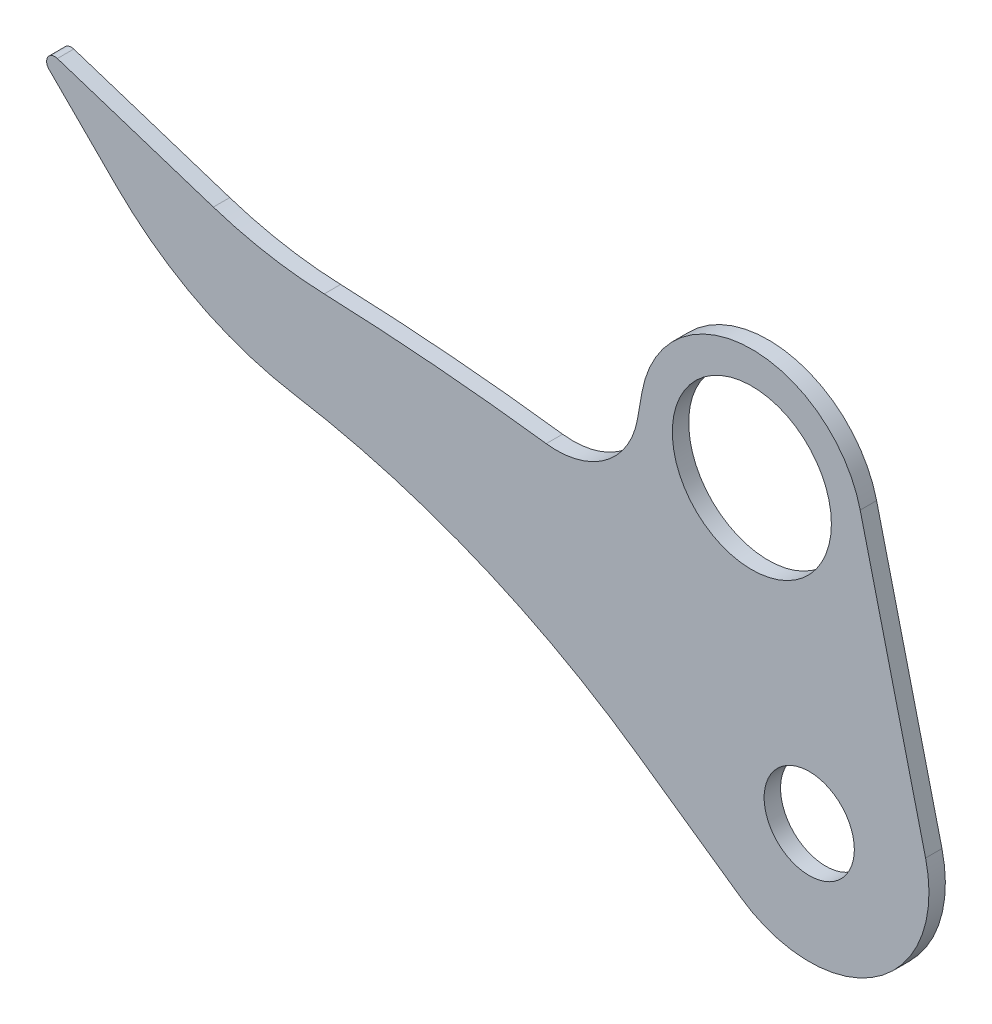
ISO-10303-21;
HEADER;
FILE_DESCRIPTION(('STEP AP214'),'2;1');
FILE_NAME('part.step','',(''),(''),'','','');
FILE_SCHEMA(('AUTOMOTIVE_DESIGN { 1 0 10303 214 1 1 1 1 }'));
ENDSEC;
DATA;
#1=APPLICATION_CONTEXT('core data for automotive mechanical design processes');
#2=APPLICATION_PROTOCOL_DEFINITION('international standard','automotive_design',2000,#1);
#3=PRODUCT_CONTEXT('',#1,'mechanical');
#4=PRODUCT('Part','Part','',(#3));
#5=PRODUCT_RELATED_PRODUCT_CATEGORY('part','',(#4));
#6=PRODUCT_DEFINITION_FORMATION('','',#4);
#7=PRODUCT_DEFINITION_CONTEXT('part definition',#1,'design');
#8=PRODUCT_DEFINITION('design','',#6,#7);
#9=PRODUCT_DEFINITION_SHAPE('','',#8);
#10=(LENGTH_UNIT() NAMED_UNIT(*) SI_UNIT(.MILLI.,.METRE.));
#11=(NAMED_UNIT(*) PLANE_ANGLE_UNIT() SI_UNIT($,.RADIAN.));
#12=(NAMED_UNIT(*) SI_UNIT($,.STERADIAN.) SOLID_ANGLE_UNIT());
#13=UNCERTAINTY_MEASURE_WITH_UNIT(LENGTH_MEASURE(1.E-05),#10,'distance_accuracy_value','');
#14=(GEOMETRIC_REPRESENTATION_CONTEXT(3) GLOBAL_UNCERTAINTY_ASSIGNED_CONTEXT((#13)) GLOBAL_UNIT_ASSIGNED_CONTEXT((#10,
#11,#12)) REPRESENTATION_CONTEXT('',''));
#15=CARTESIAN_POINT('',(0.,0.,0.));
#16=DIRECTION('',(0.,0.,1.));
#17=DIRECTION('',(1.,0.,0.));
#18=AXIS2_PLACEMENT_3D('',#15,#16,#17);
#19=CARTESIAN_POINT('',(0.,0.,10.));
#20=DIRECTION('',(0.,0.,1.));
#21=DIRECTION('',(1.,0.,0.));
#22=AXIS2_PLACEMENT_3D('',#19,#20,#21);
#23=PLANE('',#22);
#24=CARTESIAN_POINT('',(0.,0.,10.));
#25=DIRECTION('',(0.,0.,1.));
#26=DIRECTION('',(1.,0.,0.));
#27=AXIS2_PLACEMENT_3D('',#24,#25,#26);
#28=CIRCLE('',#27,27.5);
#29=CARTESIAN_POINT('',(27.5,0.,10.));
#30=VERTEX_POINT('',#29);
#31=EDGE_CURVE('E170',#30,#30,#28,.T.);
#32=ORIENTED_EDGE('',*,*,#31,.F.);
#33=EDGE_LOOP('',(#32));
#34=FACE_BOUND('',#33,.T.);
#35=CARTESIAN_POINT('',(0.,0.,10.));
#36=DIRECTION('',(0.,0.,1.));
#37=DIRECTION('',(1.,0.,0.));
#38=AXIS2_PLACEMENT_3D('',#35,#36,#37);
#39=CIRCLE('',#38,73.);
#40=CARTESIAN_POINT('',(-41.8710798536264,-59.7980992330963,10.));
#41=VERTEX_POINT('',#40);
#42=CARTESIAN_POINT('',(70.9306751457126,17.2580220006057,10.));
#43=VERTEX_POINT('',#42);
#44=EDGE_CURVE('E200',#41,#43,#39,.T.);
#45=ORIENTED_EDGE('',*,*,#44,.T.);
#46=DIRECTION('',(-0.23641126028227,0.971653084187844,0.));
#47=VECTOR('',#46,1.);
#48=CARTESIAN_POINT('',(70.9306751457126,17.2580220006057,10.));
#49=LINE('',#48,#47);
#50=CARTESIAN_POINT('',(31.0724097247734,181.075965699194,10.));
#51=VERTEX_POINT('',#50);
#52=EDGE_CURVE('E109',#43,#51,#49,.T.);
#53=ORIENTED_EDGE('',*,*,#52,.T.);
#54=CARTESIAN_POINT('',(-35.,165.,10.));
#55=DIRECTION('',(0.,0.,1.));
#56=DIRECTION('',(1.,0.,0.));
#57=AXIS2_PLACEMENT_3D('',#54,#55,#56);
#58=CIRCLE('',#57,68.);
#59=CARTESIAN_POINT('',(-101.96692720483,176.808076081351,10.));
#60=VERTEX_POINT('',#59);
#61=EDGE_CURVE('E225',#51,#60,#58,.T.);
#62=ORIENTED_EDGE('',*,*,#61,.T.);
#63=DIRECTION('',(-0.173648177666925,-0.984807753012209,0.));
#64=VECTOR('',#63,1.);
#65=CARTESIAN_POINT('',(-101.96692720483,176.808076081351,10.));
#66=LINE('',#65,#64);
#67=CARTESIAN_POINT('',(-104.698317648365,161.317591116654,10.));
#68=VERTEX_POINT('',#67);
#69=EDGE_CURVE('E237',#60,#68,#66,.T.);
#70=ORIENTED_EDGE('',*,*,#69,.T.);
#71=CARTESIAN_POINT('',(-153.938705298976,170.,10.));
#72=DIRECTION('',(0.,0.,1.));
#73=DIRECTION('',(1.,0.,0.));
#74=AXIS2_PLACEMENT_3D('',#71,#72,#73);
#75=CIRCLE('',#74,49.9999999999997);
#76=CARTESIAN_POINT('',(-160.381803444753,120.416872967875,10.));
#77=VERTEX_POINT('',#76);
#78=EDGE_CURVE('E239',#77,#68,#75,.T.);
#79=ORIENTED_EDGE('',*,*,#78,.F.);
#80=CARTESIAN_POINT('',(-353.674747818068,-1367.07693799589,10.));
#81=DIRECTION('',(0.,0.,1.));
#82=DIRECTION('',(1.,0.,0.));
#83=AXIS2_PLACEMENT_3D('',#80,#81,#82);
#84=CIRCLE('',#83,1500.);
#85=CARTESIAN_POINT('',(-295.749262378188,131.804190758677,10.));
#86=VERTEX_POINT('',#85);
#87=EDGE_CURVE('E241',#77,#86,#84,.T.);
#88=ORIENTED_EDGE('',*,*,#87,.T.);
#89=CARTESIAN_POINT('',(-286.095014804874,381.617712217771,10.));
#90=DIRECTION('',(0.,0.,-1.));
#91=DIRECTION('',(-1.,0.,0.));
#92=AXIS2_PLACEMENT_3D('',#89,#90,#91);
#93=CIRCLE('',#92,250.);
#94=CARTESIAN_POINT('',(-363.34926339861,143.853583143982,10.));
#95=VERTEX_POINT('',#94);
#96=EDGE_CURVE('E247',#86,#95,#93,.T.);
#97=ORIENTED_EDGE('',*,*,#96,.T.);
#98=DIRECTION('',(0.951056516295155,-0.309016994374942,0.));
#99=VECTOR('',#98,1.);
#100=CARTESIAN_POINT('',(-458.454915028125,174.755282581476,10.));
#101=LINE('',#100,#99);
#102=CARTESIAN_POINT('',(-458.454915028125,174.755282581476,10.));
#103=VERTEX_POINT('',#102);
#104=EDGE_CURVE('E249',#103,#95,#101,.T.);
#105=ORIENTED_EDGE('',*,*,#104,.F.);
#106=CARTESIAN_POINT('',(-460.,170.,10.));
#107=DIRECTION('',(0.,0.,-1.));
#108=DIRECTION('',(-1.,0.,0.));
#109=AXIS2_PLACEMENT_3D('',#106,#107,#108);
#110=CIRCLE('',#109,5.00000000000005);
#111=CARTESIAN_POINT('',(-463.535533905933,166.464466094067,10.));
#112=VERTEX_POINT('',#111);
#113=EDGE_CURVE('E252',#112,#103,#110,.T.);
#114=ORIENTED_EDGE('',*,*,#113,.F.);
#115=DIRECTION('',(-0.707106781186547,0.707106781186548,0.));
#116=VECTOR('',#115,1.);
#117=CARTESIAN_POINT('',(-422.516106965667,125.445039153801,10.));
#118=LINE('',#117,#116);
#119=CARTESIAN_POINT('',(-422.516106965667,125.445039153801,10.));
#120=VERTEX_POINT('',#119);
#121=EDGE_CURVE('E159',#120,#112,#118,.T.);
#122=ORIENTED_EDGE('',*,*,#121,.F.);
#123=CARTESIAN_POINT('',(-281.094750728357,266.866395391111,10.));
#124=DIRECTION('',(0.,0.,-1.));
#125=DIRECTION('',(-1.,0.,0.));
#126=AXIS2_PLACEMENT_3D('',#123,#124,#125);
#127=CIRCLE('',#126,200.);
#128=CARTESIAN_POINT('',(-313.933303894549,69.5807410065327,10.));
#129=VERTEX_POINT('',#128);
#130=EDGE_CURVE('E143',#129,#120,#127,.T.);
#131=ORIENTED_EDGE('',*,*,#130,.F.);
#132=CARTESIAN_POINT('',(-398.,-435.470534217987,10.));
#133=DIRECTION('',(0.,0.,1.));
#134=DIRECTION('',(1.,0.,0.));
#135=AXIS2_PLACEMENT_3D('',#132,#133,#134);
#136=CIRCLE('',#135,512.);
#137=CARTESIAN_POINT('',(-104.328864588264,-16.0646875420237,10.));
#138=VERTEX_POINT('',#137);
#139=EDGE_CURVE('E156',#138,#129,#136,.T.);
#140=ORIENTED_EDGE('',*,*,#139,.F.);
#141=DIRECTION('',(-0.819152044288991,0.573576436351047,0.));
#142=VECTOR('',#141,1.);
#143=CARTESIAN_POINT('',(-41.8710798536264,-59.7980992330963,10.));
#144=LINE('',#143,#142);
#145=EDGE_CURVE('E162',#41,#138,#144,.T.);
#146=ORIENTED_EDGE('',*,*,#145,.F.);
#147=EDGE_LOOP('',(#45,#53,#62,#70,#79,#88,#97,#105,#114,#122,#131,#140,#146));
#148=FACE_BOUND('',#147,.T.);
#149=CARTESIAN_POINT('',(-35.,165.,10.));
#150=DIRECTION('',(0.,0.,1.));
#151=DIRECTION('',(1.,0.,0.));
#152=AXIS2_PLACEMENT_3D('',#149,#150,#151);
#153=CIRCLE('',#152,48.5);
#154=CARTESIAN_POINT('',(13.5,165.,10.));
#155=VERTEX_POINT('',#154);
#156=EDGE_CURVE('E287',#155,#155,#153,.T.);
#157=ORIENTED_EDGE('',*,*,#156,.F.);
#158=EDGE_LOOP('',(#157));
#159=FACE_BOUND('',#158,.T.);
#160=ADVANCED_FACE('F39',(#34,#148,#159),#23,.T.);
#161=CARTESIAN_POINT('',(0.,0.,0.));
#162=DIRECTION('',(0.,0.,1.));
#163=DIRECTION('',(1.,0.,0.));
#164=AXIS2_PLACEMENT_3D('',#161,#162,#163);
#165=PLANE('',#164);
#166=CARTESIAN_POINT('',(0.,0.,0.));
#167=DIRECTION('',(0.,0.,1.));
#168=DIRECTION('',(1.,0.,0.));
#169=AXIS2_PLACEMENT_3D('',#166,#167,#168);
#170=CIRCLE('',#169,27.5);
#171=CARTESIAN_POINT('',(27.5,0.,0.));
#172=VERTEX_POINT('',#171);
#173=EDGE_CURVE('E292',#172,#172,#170,.T.);
#174=ORIENTED_EDGE('',*,*,#173,.T.);
#175=EDGE_LOOP('',(#174));
#176=FACE_BOUND('',#175,.T.);
#177=CARTESIAN_POINT('',(0.,0.,0.));
#178=DIRECTION('',(0.,0.,1.));
#179=DIRECTION('',(1.,0.,0.));
#180=AXIS2_PLACEMENT_3D('',#177,#178,#179);
#181=CIRCLE('',#180,73.);
#182=CARTESIAN_POINT('',(-41.8710798536264,-59.7980992330963,0.));
#183=VERTEX_POINT('',#182);
#184=CARTESIAN_POINT('',(70.9306751457126,17.2580220006057,0.));
#185=VERTEX_POINT('',#184);
#186=EDGE_CURVE('E167',#183,#185,#181,.T.);
#187=ORIENTED_EDGE('',*,*,#186,.F.);
#188=DIRECTION('',(-0.819152044288991,0.573576436351047,0.));
#189=VECTOR('',#188,1.);
#190=CARTESIAN_POINT('',(-41.8710798536264,-59.7980992330963,0.));
#191=LINE('',#190,#189);
#192=CARTESIAN_POINT('',(-104.328864588264,-16.0646875420237,0.));
#193=VERTEX_POINT('',#192);
#194=EDGE_CURVE('E197',#183,#193,#191,.T.);
#195=ORIENTED_EDGE('',*,*,#194,.T.);
#196=CARTESIAN_POINT('',(-398.,-435.470534217987,0.));
#197=DIRECTION('',(0.,0.,1.));
#198=DIRECTION('',(1.,0.,0.));
#199=AXIS2_PLACEMENT_3D('',#196,#197,#198);
#200=CIRCLE('',#199,512.);
#201=CARTESIAN_POINT('',(-313.933303894549,69.5807410065327,0.));
#202=VERTEX_POINT('',#201);
#203=EDGE_CURVE('E195',#193,#202,#200,.T.);
#204=ORIENTED_EDGE('',*,*,#203,.T.);
#205=CARTESIAN_POINT('',(-281.094750728357,266.866395391111,0.));
#206=DIRECTION('',(0.,0.,-1.));
#207=DIRECTION('',(-1.,0.,0.));
#208=AXIS2_PLACEMENT_3D('',#205,#206,#207);
#209=CIRCLE('',#208,200.);
#210=CARTESIAN_POINT('',(-422.516106965667,125.445039153801,0.));
#211=VERTEX_POINT('',#210);
#212=EDGE_CURVE('E145',#202,#211,#209,.T.);
#213=ORIENTED_EDGE('',*,*,#212,.T.);
#214=DIRECTION('',(-0.707106781186547,0.707106781186548,0.));
#215=VECTOR('',#214,1.);
#216=CARTESIAN_POINT('',(-422.516106965667,125.445039153801,0.));
#217=LINE('',#216,#215);
#218=CARTESIAN_POINT('',(-463.535533905933,166.464466094067,0.));
#219=VERTEX_POINT('',#218);
#220=EDGE_CURVE('E191',#211,#219,#217,.T.);
#221=ORIENTED_EDGE('',*,*,#220,.T.);
#222=CARTESIAN_POINT('',(-460.,170.,0.));
#223=DIRECTION('',(0.,0.,-1.));
#224=DIRECTION('',(-1.,0.,0.));
#225=AXIS2_PLACEMENT_3D('',#222,#223,#224);
#226=CIRCLE('',#225,5.00000000000005);
#227=CARTESIAN_POINT('',(-458.454915028125,174.755282581476,0.));
#228=VERTEX_POINT('',#227);
#229=EDGE_CURVE('E188',#219,#228,#226,.T.);
#230=ORIENTED_EDGE('',*,*,#229,.T.);
#231=DIRECTION('',(0.951056516295155,-0.309016994374942,0.));
#232=VECTOR('',#231,1.);
#233=CARTESIAN_POINT('',(-458.454915028125,174.755282581476,0.));
#234=LINE('',#233,#232);
#235=CARTESIAN_POINT('',(-363.34926339861,143.853583143982,0.));
#236=VERTEX_POINT('',#235);
#237=EDGE_CURVE('E185',#228,#236,#234,.T.);
#238=ORIENTED_EDGE('',*,*,#237,.T.);
#239=CARTESIAN_POINT('',(-286.095014804874,381.617712217771,0.));
#240=DIRECTION('',(0.,0.,-1.));
#241=DIRECTION('',(-1.,0.,0.));
#242=AXIS2_PLACEMENT_3D('',#239,#240,#241);
#243=CIRCLE('',#242,250.);
#244=CARTESIAN_POINT('',(-295.749262378188,131.804190758677,0.));
#245=VERTEX_POINT('',#244);
#246=EDGE_CURVE('E182',#245,#236,#243,.T.);
#247=ORIENTED_EDGE('',*,*,#246,.F.);
#248=CARTESIAN_POINT('',(-353.674747818068,-1367.07693799589,0.));
#249=DIRECTION('',(0.,0.,1.));
#250=DIRECTION('',(1.,0.,0.));
#251=AXIS2_PLACEMENT_3D('',#248,#249,#250);
#252=CIRCLE('',#251,1500.);
#253=CARTESIAN_POINT('',(-160.381803444753,120.416872967875,0.));
#254=VERTEX_POINT('',#253);
#255=EDGE_CURVE('E180',#254,#245,#252,.T.);
#256=ORIENTED_EDGE('',*,*,#255,.F.);
#257=CARTESIAN_POINT('',(-153.938705298976,170.,0.));
#258=DIRECTION('',(0.,0.,1.));
#259=DIRECTION('',(1.,0.,0.));
#260=AXIS2_PLACEMENT_3D('',#257,#258,#259);
#261=CIRCLE('',#260,49.9999999999997);
#262=CARTESIAN_POINT('',(-104.698317648365,161.317591116654,0.));
#263=VERTEX_POINT('',#262);
#264=EDGE_CURVE('E177',#254,#263,#261,.T.);
#265=ORIENTED_EDGE('',*,*,#264,.T.);
#266=DIRECTION('',(-0.173648177666925,-0.984807753012209,0.));
#267=VECTOR('',#266,1.);
#268=CARTESIAN_POINT('',(-101.96692720483,176.808076081351,0.));
#269=LINE('',#268,#267);
#270=CARTESIAN_POINT('',(-101.96692720483,176.808076081351,0.));
#271=VERTEX_POINT('',#270);
#272=EDGE_CURVE('E174',#271,#263,#269,.T.);
#273=ORIENTED_EDGE('',*,*,#272,.F.);
#274=CARTESIAN_POINT('',(-35.,165.,0.));
#275=DIRECTION('',(0.,0.,1.));
#276=DIRECTION('',(1.,0.,0.));
#277=AXIS2_PLACEMENT_3D('',#274,#275,#276);
#278=CIRCLE('',#277,68.);
#279=CARTESIAN_POINT('',(31.0724097247734,181.075965699194,0.));
#280=VERTEX_POINT('',#279);
#281=EDGE_CURVE('E172',#280,#271,#278,.T.);
#282=ORIENTED_EDGE('',*,*,#281,.F.);
#283=DIRECTION('',(-0.23641126028227,0.971653084187844,0.));
#284=VECTOR('',#283,1.);
#285=CARTESIAN_POINT('',(70.9306751457126,17.2580220006057,0.));
#286=LINE('',#285,#284);
#287=EDGE_CURVE('E169',#185,#280,#286,.T.);
#288=ORIENTED_EDGE('',*,*,#287,.F.);
#289=EDGE_LOOP('',(#187,#195,#204,#213,#221,#230,#238,#247,#256,#265,#273,#282,#288));
#290=FACE_BOUND('',#289,.T.);
#291=CARTESIAN_POINT('',(-35.,165.,0.));
#292=DIRECTION('',(0.,0.,1.));
#293=DIRECTION('',(1.,0.,0.));
#294=AXIS2_PLACEMENT_3D('',#291,#292,#293);
#295=CIRCLE('',#294,48.5);
#296=CARTESIAN_POINT('',(13.5,165.,0.));
#297=VERTEX_POINT('',#296);
#298=EDGE_CURVE('E290',#297,#297,#295,.T.);
#299=ORIENTED_EDGE('',*,*,#298,.T.);
#300=EDGE_LOOP('',(#299));
#301=FACE_BOUND('',#300,.T.);
#302=ADVANCED_FACE('F228',(#176,#290,#301),#165,.F.);
#303=CARTESIAN_POINT('',(0.,0.,10.));
#304=DIRECTION('',(0.,0.,-1.));
#305=DIRECTION('',(-1.,0.,0.));
#306=AXIS2_PLACEMENT_3D('',#303,#304,#305);
#307=CYLINDRICAL_SURFACE('',#306,73.);
#308=ORIENTED_EDGE('',*,*,#186,.T.);
#309=DIRECTION('',(0.,0.,-1.));
#310=VECTOR('',#309,1.);
#311=CARTESIAN_POINT('',(70.9306751457126,17.2580220006057,10.));
#312=LINE('',#311,#310);
#313=EDGE_CURVE('E11',#43,#185,#312,.T.);
#314=ORIENTED_EDGE('',*,*,#313,.F.);
#315=ORIENTED_EDGE('',*,*,#44,.F.);
#316=DIRECTION('',(0.,0.,-1.));
#317=VECTOR('',#316,1.);
#318=CARTESIAN_POINT('',(-41.8710798536264,-59.7980992330963,10.));
#319=LINE('',#318,#317);
#320=EDGE_CURVE('E56',#41,#183,#319,.T.);
#321=ORIENTED_EDGE('',*,*,#320,.T.);
#322=EDGE_LOOP('',(#308,#314,#315,#321));
#323=FACE_BOUND('',#322,.T.);
#324=ADVANCED_FACE('F41',(#323),#307,.T.);
#325=CARTESIAN_POINT('',(70.9306751457126,17.2580220006057,10.));
#326=DIRECTION('',(-0.971653084187844,-0.23641126028227,0.));
#327=DIRECTION('',(0.23641126028227,-0.971653084187844,0.));
#328=AXIS2_PLACEMENT_3D('',#325,#326,#327);
#329=PLANE('',#328);
#330=ORIENTED_EDGE('',*,*,#287,.T.);
#331=DIRECTION('',(0.,0.,-1.));
#332=VECTOR('',#331,1.);
#333=CARTESIAN_POINT('',(31.0724097247734,181.075965699194,10.));
#334=LINE('',#333,#332);
#335=EDGE_CURVE('E48',#51,#280,#334,.T.);
#336=ORIENTED_EDGE('',*,*,#335,.F.);
#337=ORIENTED_EDGE('',*,*,#52,.F.);
#338=ORIENTED_EDGE('',*,*,#313,.T.);
#339=EDGE_LOOP('',(#330,#336,#337,#338));
#340=FACE_BOUND('',#339,.T.);
#341=ADVANCED_FACE('F300',(#340),#329,.F.);
#342=CARTESIAN_POINT('',(-35.,165.,10.));
#343=DIRECTION('',(0.,0.,-1.));
#344=DIRECTION('',(-1.,0.,0.));
#345=AXIS2_PLACEMENT_3D('',#342,#343,#344);
#346=CYLINDRICAL_SURFACE('',#345,68.);
#347=ORIENTED_EDGE('',*,*,#281,.T.);
#348=DIRECTION('',(0.,0.,-1.));
#349=VECTOR('',#348,1.);
#350=CARTESIAN_POINT('',(-101.96692720483,176.808076081351,10.));
#351=LINE('',#350,#349);
#352=EDGE_CURVE('E217',#60,#271,#351,.T.);
#353=ORIENTED_EDGE('',*,*,#352,.F.);
#354=ORIENTED_EDGE('',*,*,#61,.F.);
#355=ORIENTED_EDGE('',*,*,#335,.T.);
#356=EDGE_LOOP('',(#347,#353,#354,#355));
#357=FACE_BOUND('',#356,.T.);
#358=ADVANCED_FACE('F223',(#357),#346,.T.);
#359=CARTESIAN_POINT('',(-101.96692720483,176.808076081351,10.));
#360=DIRECTION('',(0.984807753012209,-0.173648177666925,0.));
#361=DIRECTION('',(0.173648177666925,0.984807753012209,0.));
#362=AXIS2_PLACEMENT_3D('',#359,#360,#361);
#363=PLANE('',#362);
#364=ORIENTED_EDGE('',*,*,#272,.T.);
#365=DIRECTION('',(0.,0.,-1.));
#366=VECTOR('',#365,1.);
#367=CARTESIAN_POINT('',(-104.698317648365,161.317591116654,10.));
#368=LINE('',#367,#366);
#369=EDGE_CURVE('E215',#68,#263,#368,.T.);
#370=ORIENTED_EDGE('',*,*,#369,.F.);
#371=ORIENTED_EDGE('',*,*,#69,.F.);
#372=ORIENTED_EDGE('',*,*,#352,.T.);
#373=EDGE_LOOP('',(#364,#370,#371,#372));
#374=FACE_BOUND('',#373,.T.);
#375=ADVANCED_FACE('F234',(#374),#363,.F.);
#376=CARTESIAN_POINT('',(-153.938705298976,170.,10.));
#377=DIRECTION('',(0.,0.,-1.));
#378=DIRECTION('',(-1.,0.,0.));
#379=AXIS2_PLACEMENT_3D('',#376,#377,#378);
#380=CYLINDRICAL_SURFACE('',#379,49.9999999999997);
#381=ORIENTED_EDGE('',*,*,#264,.F.);
#382=DIRECTION('',(0.,0.,-1.));
#383=VECTOR('',#382,1.);
#384=CARTESIAN_POINT('',(-160.381803444753,120.416872967875,10.));
#385=LINE('',#384,#383);
#386=EDGE_CURVE('E213',#77,#254,#385,.T.);
#387=ORIENTED_EDGE('',*,*,#386,.F.);
#388=ORIENTED_EDGE('',*,*,#78,.T.);
#389=ORIENTED_EDGE('',*,*,#369,.T.);
#390=EDGE_LOOP('',(#381,#387,#388,#389));
#391=FACE_BOUND('',#390,.T.);
#392=ADVANCED_FACE('F310',(#391),#380,.F.);
#393=CARTESIAN_POINT('',(-353.674747818068,-1367.07693799589,10.));
#394=DIRECTION('',(0.,0.,-1.));
#395=DIRECTION('',(-1.,0.,0.));
#396=AXIS2_PLACEMENT_3D('',#393,#394,#395);
#397=CYLINDRICAL_SURFACE('',#396,1500.);
#398=ORIENTED_EDGE('',*,*,#255,.T.);
#399=DIRECTION('',(0.,0.,-1.));
#400=VECTOR('',#399,1.);
#401=CARTESIAN_POINT('',(-295.749262378188,131.804190758677,10.));
#402=LINE('',#401,#400);
#403=EDGE_CURVE('E210',#86,#245,#402,.T.);
#404=ORIENTED_EDGE('',*,*,#403,.F.);
#405=ORIENTED_EDGE('',*,*,#87,.F.);
#406=ORIENTED_EDGE('',*,*,#386,.T.);
#407=EDGE_LOOP('',(#398,#404,#405,#406));
#408=FACE_BOUND('',#407,.T.);
#409=ADVANCED_FACE('F313',(#408),#397,.T.);
#410=CARTESIAN_POINT('',(-286.095014804874,381.617712217771,10.));
#411=DIRECTION('',(0.,0.,-1.));
#412=DIRECTION('',(-1.,0.,0.));
#413=AXIS2_PLACEMENT_3D('',#410,#411,#412);
#414=CYLINDRICAL_SURFACE('',#413,250.);
#415=ORIENTED_EDGE('',*,*,#246,.T.);
#416=DIRECTION('',(0.,0.,-1.));
#417=VECTOR('',#416,1.);
#418=CARTESIAN_POINT('',(-363.34926339861,143.853583143982,10.));
#419=LINE('',#418,#417);
#420=EDGE_CURVE('E208',#95,#236,#419,.T.);
#421=ORIENTED_EDGE('',*,*,#420,.F.);
#422=ORIENTED_EDGE('',*,*,#96,.F.);
#423=ORIENTED_EDGE('',*,*,#403,.T.);
#424=EDGE_LOOP('',(#415,#421,#422,#423));
#425=FACE_BOUND('',#424,.T.);
#426=ADVANCED_FACE('F317',(#425),#414,.F.);
#427=CARTESIAN_POINT('',(-458.454915028125,174.755282581476,10.));
#428=DIRECTION('',(0.309016994374942,0.951056516295155,0.));
#429=DIRECTION('',(-0.951056516295155,0.309016994374942,0.));
#430=AXIS2_PLACEMENT_3D('',#427,#428,#429);
#431=PLANE('',#430);
#432=ORIENTED_EDGE('',*,*,#237,.F.);
#433=DIRECTION('',(0.,0.,-1.));
#434=VECTOR('',#433,1.);
#435=CARTESIAN_POINT('',(-458.454915028125,174.755282581476,10.));
#436=LINE('',#435,#434);
#437=EDGE_CURVE('E206',#103,#228,#436,.T.);
#438=ORIENTED_EDGE('',*,*,#437,.F.);
#439=ORIENTED_EDGE('',*,*,#104,.T.);
#440=ORIENTED_EDGE('',*,*,#420,.T.);
#441=EDGE_LOOP('',(#432,#438,#439,#440));
#442=FACE_BOUND('',#441,.T.);
#443=ADVANCED_FACE('F321',(#442),#431,.T.);
#444=CARTESIAN_POINT('',(-460.,170.,10.));
#445=DIRECTION('',(0.,0.,-1.));
#446=DIRECTION('',(-1.,0.,0.));
#447=AXIS2_PLACEMENT_3D('',#444,#445,#446);
#448=CYLINDRICAL_SURFACE('',#447,5.00000000000005);
#449=ORIENTED_EDGE('',*,*,#229,.F.);
#450=DIRECTION('',(0.,0.,-1.));
#451=VECTOR('',#450,1.);
#452=CARTESIAN_POINT('',(-463.535533905933,166.464466094067,10.));
#453=LINE('',#452,#451);
#454=EDGE_CURVE('E204',#112,#219,#453,.T.);
#455=ORIENTED_EDGE('',*,*,#454,.F.);
#456=ORIENTED_EDGE('',*,*,#113,.T.);
#457=ORIENTED_EDGE('',*,*,#437,.T.);
#458=EDGE_LOOP('',(#449,#455,#456,#457));
#459=FACE_BOUND('',#458,.T.);
#460=ADVANCED_FACE('F325',(#459),#448,.T.);
#461=CARTESIAN_POINT('',(-422.516106965667,125.445039153801,10.));
#462=DIRECTION('',(-0.707106781186548,-0.707106781186547,0.));
#463=DIRECTION('',(0.707106781186547,-0.707106781186548,0.));
#464=AXIS2_PLACEMENT_3D('',#461,#462,#463);
#465=PLANE('',#464);
#466=ORIENTED_EDGE('',*,*,#220,.F.);
#467=DIRECTION('',(0.,0.,-1.));
#468=VECTOR('',#467,1.);
#469=CARTESIAN_POINT('',(-422.516106965667,125.445039153801,10.));
#470=LINE('',#469,#468);
#471=EDGE_CURVE('E149',#120,#211,#470,.T.);
#472=ORIENTED_EDGE('',*,*,#471,.F.);
#473=ORIENTED_EDGE('',*,*,#121,.T.);
#474=ORIENTED_EDGE('',*,*,#454,.T.);
#475=EDGE_LOOP('',(#466,#472,#473,#474));
#476=FACE_BOUND('',#475,.T.);
#477=ADVANCED_FACE('F256',(#476),#465,.T.);
#478=CARTESIAN_POINT('',(-281.094750728357,266.866395391111,10.));
#479=DIRECTION('',(0.,0.,-1.));
#480=DIRECTION('',(-1.,0.,0.));
#481=AXIS2_PLACEMENT_3D('',#478,#479,#480);
#482=CYLINDRICAL_SURFACE('',#481,200.);
#483=ORIENTED_EDGE('',*,*,#212,.F.);
#484=DIRECTION('',(0.,0.,-1.));
#485=VECTOR('',#484,1.);
#486=CARTESIAN_POINT('',(-313.933303894549,69.5807410065327,10.));
#487=LINE('',#486,#485);
#488=EDGE_CURVE('E140',#129,#202,#487,.T.);
#489=ORIENTED_EDGE('',*,*,#488,.F.);
#490=ORIENTED_EDGE('',*,*,#130,.T.);
#491=ORIENTED_EDGE('',*,*,#471,.T.);
#492=EDGE_LOOP('',(#483,#489,#490,#491));
#493=FACE_BOUND('',#492,.T.);
#494=ADVANCED_FACE('F142',(#493),#482,.T.);
#495=CARTESIAN_POINT('',(-398.,-435.470534217987,10.));
#496=DIRECTION('',(0.,0.,-1.));
#497=DIRECTION('',(-1.,0.,0.));
#498=AXIS2_PLACEMENT_3D('',#495,#496,#497);
#499=CYLINDRICAL_SURFACE('',#498,512.);
#500=ORIENTED_EDGE('',*,*,#203,.F.);
#501=DIRECTION('',(0.,0.,-1.));
#502=VECTOR('',#501,1.);
#503=CARTESIAN_POINT('',(-104.328864588264,-16.0646875420237,10.));
#504=LINE('',#503,#502);
#505=EDGE_CURVE('E97',#138,#193,#504,.T.);
#506=ORIENTED_EDGE('',*,*,#505,.F.);
#507=ORIENTED_EDGE('',*,*,#139,.T.);
#508=ORIENTED_EDGE('',*,*,#488,.T.);
#509=EDGE_LOOP('',(#500,#506,#507,#508));
#510=FACE_BOUND('',#509,.T.);
#511=ADVANCED_FACE('F161',(#510),#499,.F.);
#512=CARTESIAN_POINT('',(-41.8710798536264,-59.7980992330963,10.));
#513=DIRECTION('',(-0.573576436351047,-0.819152044288991,0.));
#514=DIRECTION('',(0.819152044288991,-0.573576436351047,0.));
#515=AXIS2_PLACEMENT_3D('',#512,#513,#514);
#516=PLANE('',#515);
#517=ORIENTED_EDGE('',*,*,#194,.F.);
#518=ORIENTED_EDGE('',*,*,#320,.F.);
#519=ORIENTED_EDGE('',*,*,#145,.T.);
#520=ORIENTED_EDGE('',*,*,#505,.T.);
#521=EDGE_LOOP('',(#517,#518,#519,#520));
#522=FACE_BOUND('',#521,.T.);
#523=ADVANCED_FACE('F258',(#522),#516,.T.);
#524=CARTESIAN_POINT('',(0.,0.,10.));
#525=DIRECTION('',(0.,0.,-1.));
#526=DIRECTION('',(-1.,0.,0.));
#527=AXIS2_PLACEMENT_3D('',#524,#525,#526);
#528=CYLINDRICAL_SURFACE('',#527,27.5);
#529=ORIENTED_EDGE('',*,*,#31,.T.);
#530=EDGE_LOOP('',(#529));
#531=FACE_BOUND('',#530,.T.);
#532=ORIENTED_EDGE('',*,*,#173,.F.);
#533=EDGE_LOOP('',(#532));
#534=FACE_BOUND('',#533,.T.);
#535=ADVANCED_FACE('F260',(#531,#534),#528,.F.);
#536=CARTESIAN_POINT('',(-35.,165.,10.));
#537=DIRECTION('',(0.,0.,-1.));
#538=DIRECTION('',(-1.,0.,0.));
#539=AXIS2_PLACEMENT_3D('',#536,#537,#538);
#540=CYLINDRICAL_SURFACE('',#539,48.5);
#541=ORIENTED_EDGE('',*,*,#156,.T.);
#542=EDGE_LOOP('',(#541));
#543=FACE_BOUND('',#542,.T.);
#544=ORIENTED_EDGE('',*,*,#298,.F.);
#545=EDGE_LOOP('',(#544));
#546=FACE_BOUND('',#545,.T.);
#547=ADVANCED_FACE('F266',(#543,#546),#540,.F.);
#548=CLOSED_SHELL('',(#160,#302,#324,#341,#358,#375,#392,#409,#426,#443,#460,#477,#494,#511,
#523,#535,#547));
#549=MANIFOLD_SOLID_BREP('B2',#548);
#550=ADVANCED_BREP_SHAPE_REPRESENTATION('',(#18,#549),#14);
#551=SHAPE_DEFINITION_REPRESENTATION(#9,#550);
ENDSEC;
END-ISO-10303-21;
